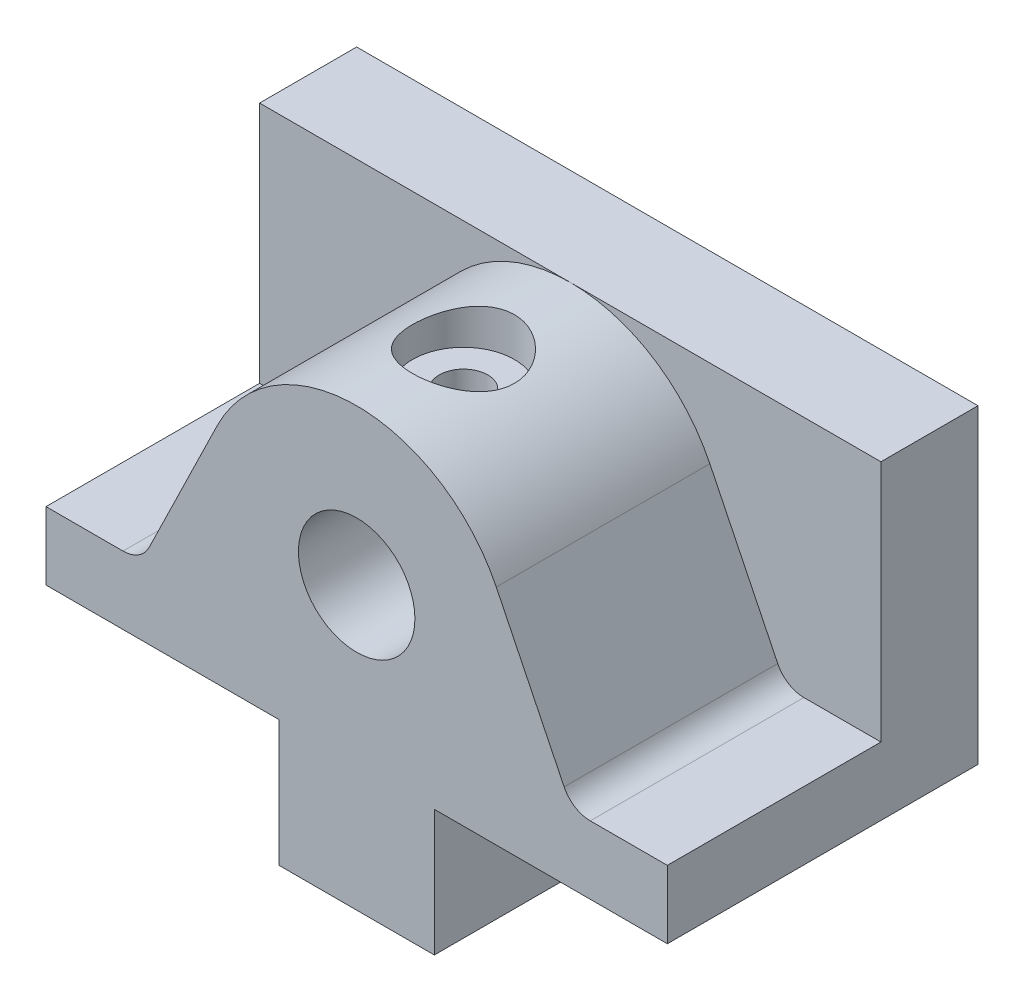
ISO-10303-21;
HEADER;
FILE_DESCRIPTION(('STEP AP214'),'2;1');
FILE_NAME('part.step','',(''),(''),'','','');
FILE_SCHEMA(('AUTOMOTIVE_DESIGN { 1 0 10303 214 1 1 1 1 }'));
ENDSEC;
DATA;
#1=APPLICATION_CONTEXT('core data for automotive mechanical design processes');
#2=APPLICATION_PROTOCOL_DEFINITION('international standard','automotive_design',2000,#1);
#3=PRODUCT_CONTEXT('',#1,'mechanical');
#4=PRODUCT('Part','Part','',(#3));
#5=PRODUCT_RELATED_PRODUCT_CATEGORY('part','',(#4));
#6=PRODUCT_DEFINITION_FORMATION('','',#4);
#7=PRODUCT_DEFINITION_CONTEXT('part definition',#1,'design');
#8=PRODUCT_DEFINITION('design','',#6,#7);
#9=PRODUCT_DEFINITION_SHAPE('','',#8);
#10=(LENGTH_UNIT() NAMED_UNIT(*) SI_UNIT(.MILLI.,.METRE.));
#11=(NAMED_UNIT(*) PLANE_ANGLE_UNIT() SI_UNIT($,.RADIAN.));
#12=(NAMED_UNIT(*) SI_UNIT($,.STERADIAN.) SOLID_ANGLE_UNIT());
#13=UNCERTAINTY_MEASURE_WITH_UNIT(LENGTH_MEASURE(1.E-05),#10,'distance_accuracy_value','');
#14=(GEOMETRIC_REPRESENTATION_CONTEXT(3) GLOBAL_UNCERTAINTY_ASSIGNED_CONTEXT((#13)) GLOBAL_UNIT_ASSIGNED_CONTEXT((#10,
#11,#12)) REPRESENTATION_CONTEXT('',''));
#15=CARTESIAN_POINT('',(0.,0.,0.));
#16=DIRECTION('',(0.,0.,1.));
#17=DIRECTION('',(1.,0.,0.));
#18=AXIS2_PLACEMENT_3D('',#15,#16,#17);
#19=CARTESIAN_POINT('',(0.,0.,32.));
#20=DIRECTION('',(0.,0.,-1.));
#21=DIRECTION('',(-1.,0.,0.));
#22=AXIS2_PLACEMENT_3D('',#19,#20,#21);
#23=PLANE('',#22);
#24=CARTESIAN_POINT('',(-5.13901892937107,9.13494809688582,32.));
#25=DIRECTION('',(0.,0.,1.));
#26=DIRECTION('',(1.,0.,0.));
#27=AXIS2_PLACEMENT_3D('',#24,#25,#26);
#28=CIRCLE('',#27,6.);
#29=CARTESIAN_POINT('',(0.86098107062893,9.13494809688582,32.));
#30=VERTEX_POINT('',#29);
#31=EDGE_CURVE('E332',#30,#30,#28,.T.);
#32=ORIENTED_EDGE('',*,*,#31,.F.);
#33=EDGE_LOOP('',(#32));
#34=FACE_BOUND('',#33,.T.);
#35=DIRECTION('',(0.438371146789079,-0.898794046299166,0.));
#36=VECTOR('',#35,1.);
#37=CARTESIAN_POINT('',(13.8284659552022,6.7445934962257,32.));
#38=LINE('',#37,#36);
#39=CARTESIAN_POINT('',(9.24168581141559,16.1488864455111,32.));
#40=VERTEX_POINT('',#39);
#41=CARTESIAN_POINT('',(16.2304313321552,1.81983465651859,32.));
#42=VERTEX_POINT('',#41);
#43=EDGE_CURVE('E420',#40,#42,#38,.T.);
#44=ORIENTED_EDGE('',*,*,#43,.F.);
#45=CARTESIAN_POINT('',(-5.13901892937107,9.13494809688582,32.));
#46=DIRECTION('',(0.,0.,1.));
#47=DIRECTION('',(1.,0.,0.));
#48=AXIS2_PLACEMENT_3D('',#45,#46,#47);
#49=CIRCLE('',#48,16.);
#50=CARTESIAN_POINT('',(-19.5197236701577,16.1488864455111,32.));
#51=VERTEX_POINT('',#50);
#52=EDGE_CURVE('E321',#40,#51,#49,.T.);
#53=ORIENTED_EDGE('',*,*,#52,.T.);
#54=DIRECTION('',(-0.438371146789079,-0.898794046299166,0.));
#55=VECTOR('',#54,1.);
#56=CARTESIAN_POINT('',(-22.1313808603564,10.7941956755586,32.));
#57=LINE('',#56,#55);
#58=CARTESIAN_POINT('',(-26.5084691908974,1.81983465651859,32.));
#59=VERTEX_POINT('',#58);
#60=EDGE_CURVE('E315',#51,#59,#57,.T.);
#61=ORIENTED_EDGE('',*,*,#60,.T.);
#62=CARTESIAN_POINT('',(-29.2048513297949,3.13494809688582,32.));
#63=DIRECTION('',(0.,0.,-1.));
#64=DIRECTION('',(-1.,0.,0.));
#65=AXIS2_PLACEMENT_3D('',#62,#63,#64);
#66=CIRCLE('',#65,3.);
#67=CARTESIAN_POINT('',(-29.2048513297949,0.134948096885821,32.));
#68=VERTEX_POINT('',#67);
#69=EDGE_CURVE('E309',#59,#68,#66,.T.);
#70=ORIENTED_EDGE('',*,*,#69,.T.);
#71=DIRECTION('',(-1.,0.,0.));
#72=VECTOR('',#71,1.);
#73=CARTESIAN_POINT('',(0.,0.134948096885832,32.));
#74=LINE('',#73,#72);
#75=CARTESIAN_POINT('',(-37.1390189293711,0.13494809688582,32.));
#76=VERTEX_POINT('',#75);
#77=EDGE_CURVE('E312',#68,#76,#74,.T.);
#78=ORIENTED_EDGE('',*,*,#77,.T.);
#79=DIRECTION('',(0.,-1.,0.));
#80=VECTOR('',#79,1.);
#81=CARTESIAN_POINT('',(-37.1390189293711,-6.86505190311419,32.));
#82=LINE('',#81,#80);
#83=CARTESIAN_POINT('',(-37.1390189293711,-6.86505190311419,32.));
#84=VERTEX_POINT('',#83);
#85=EDGE_CURVE('E367',#76,#84,#82,.T.);
#86=ORIENTED_EDGE('',*,*,#85,.T.);
#87=DIRECTION('',(1.,0.,0.));
#88=VECTOR('',#87,1.);
#89=CARTESIAN_POINT('',(26.8609810706289,-6.86505190311418,32.));
#90=LINE('',#89,#88);
#91=CARTESIAN_POINT('',(-13.1390189293711,-6.86505190311419,32.));
#92=VERTEX_POINT('',#91);
#93=EDGE_CURVE('E371',#84,#92,#90,.T.);
#94=ORIENTED_EDGE('',*,*,#93,.T.);
#95=DIRECTION('',(0.,-1.,0.));
#96=VECTOR('',#95,1.);
#97=CARTESIAN_POINT('',(-13.1390189293711,-6.86505190311419,32.));
#98=LINE('',#97,#96);
#99=CARTESIAN_POINT('',(-13.1390189293711,-19.8650519031142,32.));
#100=VERTEX_POINT('',#99);
#101=EDGE_CURVE('E338',#92,#100,#98,.T.);
#102=ORIENTED_EDGE('',*,*,#101,.T.);
#103=DIRECTION('',(1.,0.,0.));
#104=VECTOR('',#103,1.);
#105=CARTESIAN_POINT('',(-5.13901892937107,-19.8650519031142,32.));
#106=LINE('',#105,#104);
#107=CARTESIAN_POINT('',(2.86098107062893,-19.8650519031142,32.));
#108=VERTEX_POINT('',#107);
#109=EDGE_CURVE('E352',#100,#108,#106,.T.);
#110=ORIENTED_EDGE('',*,*,#109,.T.);
#111=DIRECTION('',(0.,1.,0.));
#112=VECTOR('',#111,1.);
#113=CARTESIAN_POINT('',(2.86098107062893,-19.8650519031142,32.));
#114=LINE('',#113,#112);
#115=CARTESIAN_POINT('',(2.86098107062893,-6.86505190311419,32.));
#116=VERTEX_POINT('',#115);
#117=EDGE_CURVE('E345',#108,#116,#114,.T.);
#118=ORIENTED_EDGE('',*,*,#117,.T.);
#119=CARTESIAN_POINT('',(26.8609810706289,-6.86505190311418,32.));
#120=VERTEX_POINT('',#119);
#121=EDGE_CURVE('E369',#116,#120,#90,.T.);
#122=ORIENTED_EDGE('',*,*,#121,.T.);
#123=DIRECTION('',(0.,1.,0.));
#124=VECTOR('',#123,1.);
#125=CARTESIAN_POINT('',(26.8609810706289,25.1349480968858,32.));
#126=LINE('',#125,#124);
#127=CARTESIAN_POINT('',(26.8609810706289,0.134948096885821,32.));
#128=VERTEX_POINT('',#127);
#129=EDGE_CURVE('E374',#120,#128,#126,.T.);
#130=ORIENTED_EDGE('',*,*,#129,.T.);
#131=DIRECTION('',(-1.,0.,0.));
#132=VECTOR('',#131,1.);
#133=CARTESIAN_POINT('',(0.,0.134948096885827,32.));
#134=LINE('',#133,#132);
#135=CARTESIAN_POINT('',(18.9268134710527,0.134948096885821,32.));
#136=VERTEX_POINT('',#135);
#137=EDGE_CURVE('E417',#128,#136,#134,.T.);
#138=ORIENTED_EDGE('',*,*,#137,.T.);
#139=CARTESIAN_POINT('',(18.9268134710527,3.13494809688582,32.));
#140=DIRECTION('',(0.,0.,-1.));
#141=DIRECTION('',(-1.,0.,0.));
#142=AXIS2_PLACEMENT_3D('',#139,#140,#141);
#143=CIRCLE('',#142,3.);
#144=EDGE_CURVE('E79',#136,#42,#143,.T.);
#145=ORIENTED_EDGE('',*,*,#144,.T.);
#146=EDGE_LOOP('',(#44,#53,#61,#70,#78,#86,#94,#102,#110,#118,#122,#130,#138,#145));
#147=FACE_BOUND('',#146,.T.);
#148=ADVANCED_FACE('F66',(#34,#147),#23,.F.);
#149=CARTESIAN_POINT('',(26.8609810706289,25.1349480968858,32.));
#150=DIRECTION('',(-1.,0.,0.));
#151=DIRECTION('',(0.,-1.,0.));
#152=AXIS2_PLACEMENT_3D('',#149,#150,#151);
#153=PLANE('',#152);
#154=DIRECTION('',(0.,0.,1.));
#155=VECTOR('',#154,1.);
#156=CARTESIAN_POINT('',(26.8609810706289,0.134948096885821,10.));
#157=LINE('',#156,#155);
#158=CARTESIAN_POINT('',(26.8609810706289,0.134948096885821,10.));
#159=VERTEX_POINT('',#158);
#160=EDGE_CURVE('E325',#159,#128,#157,.T.);
#161=ORIENTED_EDGE('',*,*,#160,.T.);
#162=ORIENTED_EDGE('',*,*,#129,.F.);
#163=DIRECTION('',(0.,0.,-1.));
#164=VECTOR('',#163,1.);
#165=CARTESIAN_POINT('',(26.8609810706289,-6.86505190311418,32.));
#166=LINE('',#165,#164);
#167=CARTESIAN_POINT('',(26.8609810706289,-6.86505190311418,0.));
#168=VERTEX_POINT('',#167);
#169=EDGE_CURVE('E392',#120,#168,#166,.T.);
#170=ORIENTED_EDGE('',*,*,#169,.T.);
#171=DIRECTION('',(0.,1.,0.));
#172=VECTOR('',#171,1.);
#173=CARTESIAN_POINT('',(26.8609810706289,25.1349480968858,0.));
#174=LINE('',#173,#172);
#175=CARTESIAN_POINT('',(26.8609810706289,25.1349480968858,0.));
#176=VERTEX_POINT('',#175);
#177=EDGE_CURVE('E384',#168,#176,#174,.T.);
#178=ORIENTED_EDGE('',*,*,#177,.T.);
#179=DIRECTION('',(0.,0.,-1.));
#180=VECTOR('',#179,1.);
#181=CARTESIAN_POINT('',(26.8609810706289,25.1349480968858,32.));
#182=LINE('',#181,#180);
#183=CARTESIAN_POINT('',(26.8609810706289,25.1349480968858,10.));
#184=VERTEX_POINT('',#183);
#185=EDGE_CURVE('E390',#184,#176,#182,.T.);
#186=ORIENTED_EDGE('',*,*,#185,.F.);
#187=DIRECTION('',(0.,1.,0.));
#188=VECTOR('',#187,1.);
#189=CARTESIAN_POINT('',(26.8609810706289,0.,10.));
#190=LINE('',#189,#188);
#191=EDGE_CURVE('E423',#159,#184,#190,.T.);
#192=ORIENTED_EDGE('',*,*,#191,.F.);
#193=EDGE_LOOP('',(#161,#162,#170,#178,#186,#192));
#194=FACE_BOUND('',#193,.T.);
#195=ADVANCED_FACE('F246',(#194),#153,.F.);
#196=CARTESIAN_POINT('',(-37.1390189293711,25.1349480968858,32.));
#197=DIRECTION('',(0.,-1.,0.));
#198=DIRECTION('',(0.,0.,-1.));
#199=AXIS2_PLACEMENT_3D('',#196,#197,#198);
#200=PLANE('',#199);
#201=DIRECTION('',(-1.,0.,0.));
#202=VECTOR('',#201,1.);
#203=CARTESIAN_POINT('',(0.,25.1349480968858,10.));
#204=LINE('',#203,#202);
#205=CARTESIAN_POINT('',(-5.13901892937107,25.1349480968858,10.));
#206=VERTEX_POINT('',#205);
#207=EDGE_CURVE('E414',#184,#206,#204,.T.);
#208=ORIENTED_EDGE('',*,*,#207,.F.);
#209=ORIENTED_EDGE('',*,*,#185,.T.);
#210=DIRECTION('',(-1.,0.,0.));
#211=VECTOR('',#210,1.);
#212=CARTESIAN_POINT('',(-37.1390189293711,25.1349480968858,0.));
#213=LINE('',#212,#211);
#214=CARTESIAN_POINT('',(-37.1390189293711,25.1349480968858,0.));
#215=VERTEX_POINT('',#214);
#216=EDGE_CURVE('E370',#176,#215,#213,.T.);
#217=ORIENTED_EDGE('',*,*,#216,.T.);
#218=DIRECTION('',(0.,0.,-1.));
#219=VECTOR('',#218,1.);
#220=CARTESIAN_POINT('',(-37.1390189293711,25.1349480968858,32.));
#221=LINE('',#220,#219);
#222=CARTESIAN_POINT('',(-37.1390189293711,25.1349480968858,10.));
#223=VERTEX_POINT('',#222);
#224=EDGE_CURVE('E377',#223,#215,#221,.T.);
#225=ORIENTED_EDGE('',*,*,#224,.F.);
#226=DIRECTION('',(-1.,0.,0.));
#227=VECTOR('',#226,1.);
#228=CARTESIAN_POINT('',(0.,25.1349480968858,10.));
#229=LINE('',#228,#227);
#230=EDGE_CURVE('E408',#206,#223,#229,.T.);
#231=ORIENTED_EDGE('',*,*,#230,.F.);
#232=EDGE_LOOP('',(#208,#209,#217,#225,#231));
#233=FACE_BOUND('',#232,.T.);
#234=ADVANCED_FACE('F252',(#233),#200,.F.);
#235=CARTESIAN_POINT('',(-37.1390189293711,-6.86505190311419,32.));
#236=DIRECTION('',(1.,0.,0.));
#237=DIRECTION('',(0.,1.,0.));
#238=AXIS2_PLACEMENT_3D('',#235,#236,#237);
#239=PLANE('',#238);
#240=DIRECTION('',(0.,0.,1.));
#241=VECTOR('',#240,1.);
#242=CARTESIAN_POINT('',(-37.1390189293711,0.13494809688582,10.));
#243=LINE('',#242,#241);
#244=CARTESIAN_POINT('',(-37.1390189293711,0.13494809688582,10.));
#245=VERTEX_POINT('',#244);
#246=EDGE_CURVE('E319',#245,#76,#243,.T.);
#247=ORIENTED_EDGE('',*,*,#246,.F.);
#248=DIRECTION('',(0.,-1.,0.));
#249=VECTOR('',#248,1.);
#250=CARTESIAN_POINT('',(-37.1390189293711,0.,10.));
#251=LINE('',#250,#249);
#252=EDGE_CURVE('E403',#223,#245,#251,.T.);
#253=ORIENTED_EDGE('',*,*,#252,.F.);
#254=ORIENTED_EDGE('',*,*,#224,.T.);
#255=DIRECTION('',(0.,-1.,0.));
#256=VECTOR('',#255,1.);
#257=CARTESIAN_POINT('',(-37.1390189293711,-6.86505190311419,0.));
#258=LINE('',#257,#256);
#259=CARTESIAN_POINT('',(-37.1390189293711,-6.86505190311419,0.));
#260=VERTEX_POINT('',#259);
#261=EDGE_CURVE('E359',#215,#260,#258,.T.);
#262=ORIENTED_EDGE('',*,*,#261,.T.);
#263=DIRECTION('',(0.,0.,-1.));
#264=VECTOR('',#263,1.);
#265=CARTESIAN_POINT('',(-37.1390189293711,-6.86505190311419,32.));
#266=LINE('',#265,#264);
#267=EDGE_CURVE('E395',#84,#260,#266,.T.);
#268=ORIENTED_EDGE('',*,*,#267,.F.);
#269=ORIENTED_EDGE('',*,*,#85,.F.);
#270=EDGE_LOOP('',(#247,#253,#254,#262,#268,#269));
#271=FACE_BOUND('',#270,.T.);
#272=ADVANCED_FACE('F267',(#271),#239,.F.);
#273=CARTESIAN_POINT('',(26.8609810706289,-6.86505190311418,32.));
#274=DIRECTION('',(0.,1.,0.));
#275=DIRECTION('',(-1.,0.,0.));
#276=AXIS2_PLACEMENT_3D('',#273,#274,#275);
#277=PLANE('',#276);
#278=DIRECTION('',(0.,0.,1.));
#279=VECTOR('',#278,1.);
#280=CARTESIAN_POINT('',(2.86098107062893,-6.86505190311419,0.));
#281=LINE('',#280,#279);
#282=CARTESIAN_POINT('',(2.86098107062893,-6.86505190311419,0.));
#283=VERTEX_POINT('',#282);
#284=EDGE_CURVE('E357',#283,#116,#281,.T.);
#285=ORIENTED_EDGE('',*,*,#284,.F.);
#286=DIRECTION('',(1.,0.,0.));
#287=VECTOR('',#286,1.);
#288=CARTESIAN_POINT('',(26.8609810706289,-6.86505190311418,0.));
#289=LINE('',#288,#287);
#290=EDGE_CURVE('E380',#283,#168,#289,.T.);
#291=ORIENTED_EDGE('',*,*,#290,.T.);
#292=ORIENTED_EDGE('',*,*,#169,.F.);
#293=ORIENTED_EDGE('',*,*,#121,.F.);
#294=EDGE_LOOP('',(#285,#291,#292,#293));
#295=FACE_BOUND('',#294,.T.);
#296=ADVANCED_FACE('F272',(#295),#277,.F.);
#297=CARTESIAN_POINT('',(-13.1390189293711,-6.86505190311419,0.));
#298=VERTEX_POINT('',#297);
#299=EDGE_CURVE('E381',#260,#298,#289,.T.);
#300=ORIENTED_EDGE('',*,*,#299,.T.);
#301=DIRECTION('',(0.,0.,1.));
#302=VECTOR('',#301,1.);
#303=CARTESIAN_POINT('',(-13.1390189293711,-6.86505190311419,0.));
#304=LINE('',#303,#302);
#305=EDGE_CURVE('E349',#298,#92,#304,.T.);
#306=ORIENTED_EDGE('',*,*,#305,.T.);
#307=ORIENTED_EDGE('',*,*,#93,.F.);
#308=ORIENTED_EDGE('',*,*,#267,.T.);
#309=EDGE_LOOP('',(#300,#306,#307,#308));
#310=FACE_BOUND('',#309,.T.);
#311=ADVANCED_FACE('F264',(#310),#277,.F.);
#312=CARTESIAN_POINT('',(0.,0.,0.));
#313=DIRECTION('',(0.,0.,-1.));
#314=DIRECTION('',(-1.,0.,0.));
#315=AXIS2_PLACEMENT_3D('',#312,#313,#314);
#316=PLANE('',#315);
#317=ORIENTED_EDGE('',*,*,#261,.F.);
#318=ORIENTED_EDGE('',*,*,#216,.F.);
#319=ORIENTED_EDGE('',*,*,#177,.F.);
#320=ORIENTED_EDGE('',*,*,#290,.F.);
#321=DIRECTION('',(0.,1.,0.));
#322=VECTOR('',#321,1.);
#323=CARTESIAN_POINT('',(2.86098107062893,-19.8650519031142,0.));
#324=LINE('',#323,#322);
#325=CARTESIAN_POINT('',(2.86098107062893,-19.8650519031142,0.));
#326=VERTEX_POINT('',#325);
#327=EDGE_CURVE('E347',#326,#283,#324,.T.);
#328=ORIENTED_EDGE('',*,*,#327,.F.);
#329=DIRECTION('',(1.,0.,0.));
#330=VECTOR('',#329,1.);
#331=CARTESIAN_POINT('',(-13.1390189293711,-19.8650519031142,0.));
#332=LINE('',#331,#330);
#333=CARTESIAN_POINT('',(-13.1390189293711,-19.8650519031142,0.));
#334=VERTEX_POINT('',#333);
#335=EDGE_CURVE('E344',#334,#326,#332,.T.);
#336=ORIENTED_EDGE('',*,*,#335,.F.);
#337=DIRECTION('',(0.,-1.,0.));
#338=VECTOR('',#337,1.);
#339=CARTESIAN_POINT('',(-13.1390189293711,-6.86505190311419,0.));
#340=LINE('',#339,#338);
#341=EDGE_CURVE('E341',#298,#334,#340,.T.);
#342=ORIENTED_EDGE('',*,*,#341,.F.);
#343=ORIENTED_EDGE('',*,*,#299,.F.);
#344=EDGE_LOOP('',(#317,#318,#319,#320,#328,#336,#342,#343));
#345=FACE_BOUND('',#344,.T.);
#346=ADVANCED_FACE('F260',(#345),#316,.T.);
#347=CARTESIAN_POINT('',(2.86098107062893,-19.8650519031142,0.));
#348=DIRECTION('',(1.,0.,0.));
#349=DIRECTION('',(0.,0.,-1.));
#350=AXIS2_PLACEMENT_3D('',#347,#348,#349);
#351=PLANE('',#350);
#352=ORIENTED_EDGE('',*,*,#117,.F.);
#353=DIRECTION('',(0.,0.,1.));
#354=VECTOR('',#353,1.);
#355=CARTESIAN_POINT('',(2.86098107062893,-19.8650519031142,0.));
#356=LINE('',#355,#354);
#357=EDGE_CURVE('E360',#326,#108,#356,.T.);
#358=ORIENTED_EDGE('',*,*,#357,.F.);
#359=ORIENTED_EDGE('',*,*,#327,.T.);
#360=ORIENTED_EDGE('',*,*,#284,.T.);
#361=EDGE_LOOP('',(#352,#358,#359,#360));
#362=FACE_BOUND('',#361,.T.);
#363=ADVANCED_FACE('F263',(#362),#351,.T.);
#364=CARTESIAN_POINT('',(-5.13901892937107,-19.8650519031142,0.));
#365=DIRECTION('',(0.,-1.,0.));
#366=DIRECTION('',(0.,0.,-1.));
#367=AXIS2_PLACEMENT_3D('',#364,#365,#366);
#368=PLANE('',#367);
#369=CARTESIAN_POINT('',(-5.13901892937107,-19.8650519031142,24.));
#370=DIRECTION('',(0.,-1.,0.));
#371=DIRECTION('',(0.,0.,-1.));
#372=AXIS2_PLACEMENT_3D('',#369,#370,#371);
#373=CIRCLE('',#372,2.49999999999999);
#374=CARTESIAN_POINT('',(-5.13901892937107,-19.8650519031142,21.5));
#375=VERTEX_POINT('',#374);
#376=EDGE_CURVE('E203',#375,#375,#373,.T.);
#377=ORIENTED_EDGE('',*,*,#376,.F.);
#378=EDGE_LOOP('',(#377));
#379=FACE_BOUND('',#378,.T.);
#380=CARTESIAN_POINT('',(-5.13901892937107,-19.8650519031142,8.));
#381=DIRECTION('',(0.,-1.,0.));
#382=DIRECTION('',(0.,0.,-1.));
#383=AXIS2_PLACEMENT_3D('',#380,#381,#382);
#384=CIRCLE('',#383,2.49999999999999);
#385=CARTESIAN_POINT('',(-5.13901892937107,-19.8650519031142,5.50000000000001));
#386=VERTEX_POINT('',#385);
#387=EDGE_CURVE('E202',#386,#386,#384,.T.);
#388=ORIENTED_EDGE('',*,*,#387,.F.);
#389=EDGE_LOOP('',(#388));
#390=FACE_BOUND('',#389,.T.);
#391=ORIENTED_EDGE('',*,*,#109,.F.);
#392=DIRECTION('',(0.,0.,1.));
#393=VECTOR('',#392,1.);
#394=CARTESIAN_POINT('',(-13.1390189293711,-19.8650519031142,0.));
#395=LINE('',#394,#393);
#396=EDGE_CURVE('E362',#334,#100,#395,.T.);
#397=ORIENTED_EDGE('',*,*,#396,.F.);
#398=ORIENTED_EDGE('',*,*,#335,.T.);
#399=ORIENTED_EDGE('',*,*,#357,.T.);
#400=EDGE_LOOP('',(#391,#397,#398,#399));
#401=FACE_BOUND('',#400,.T.);
#402=ADVANCED_FACE('F450',(#379,#390,#401),#368,.T.);
#403=CARTESIAN_POINT('',(-13.1390189293711,-6.86505190311419,0.));
#404=DIRECTION('',(-1.,0.,0.));
#405=DIRECTION('',(0.,-1.,0.));
#406=AXIS2_PLACEMENT_3D('',#403,#404,#405);
#407=PLANE('',#406);
#408=ORIENTED_EDGE('',*,*,#101,.F.);
#409=ORIENTED_EDGE('',*,*,#305,.F.);
#410=ORIENTED_EDGE('',*,*,#341,.T.);
#411=ORIENTED_EDGE('',*,*,#396,.T.);
#412=EDGE_LOOP('',(#408,#409,#410,#411));
#413=FACE_BOUND('',#412,.T.);
#414=ADVANCED_FACE('F258',(#413),#407,.T.);
#415=CARTESIAN_POINT('',(-5.13901892937107,9.13494809688582,10.));
#416=DIRECTION('',(0.,0.,1.));
#417=DIRECTION('',(1.,0.,0.));
#418=AXIS2_PLACEMENT_3D('',#415,#416,#417);
#419=CYLINDRICAL_SURFACE('',#418,6.);
#420=CARTESIAN_POINT('',(-5.13901892937107,15.1349480968858,23.5));
#421=CARTESIAN_POINT('',(-5.00511501120728,15.1349443797949,23.4999952878604));
#422=CARTESIAN_POINT('',(-4.87097940437964,15.1304146650975,23.4891786843995));
#423=CARTESIAN_POINT('',(-4.60652090937996,15.112749254772,23.4463192619064));
#424=CARTESIAN_POINT('',(-4.4762088995624,15.0995911028837,23.4142210532185));
#425=CARTESIAN_POINT('',(-4.22364233607185,15.0660743879459,23.3301785119407));
#426=CARTESIAN_POINT('',(-4.10136211502723,15.0457402333061,23.2783014076769));
#427=CARTESIAN_POINT('',(-3.86735918157374,14.9998536894203,23.1564541669781));
#428=CARTESIAN_POINT('',(-3.7556332852082,14.9743028812993,23.0864895110252));
#429=CARTESIAN_POINT('',(-3.5401221893251,14.9191047030845,22.9267420881925));
#430=CARTESIAN_POINT('',(-3.43693641234066,14.8893231739201,22.8361973967483));
#431=CARTESIAN_POINT('',(-3.24669926917398,14.8296023677381,22.6394713160995));
#432=CARTESIAN_POINT('',(-3.15965639813118,14.7996630161414,22.5332817462849));
#433=CARTESIAN_POINT('',(-2.99994418060624,14.7413685361681,22.3019464489895));
#434=CARTESIAN_POINT('',(-2.92819276767697,14.7131638351618,22.1761251042486));
#435=CARTESIAN_POINT('',(-2.80714011621008,14.663659543218,21.9128534830571));
#436=CARTESIAN_POINT('',(-2.75782731228309,14.6423563966908,21.7754092407429));
#437=CARTESIAN_POINT('',(-2.68552696347262,14.6105192048412,21.4996926167385));
#438=CARTESIAN_POINT('',(-2.66138577191106,14.5995158499753,21.361779033289));
#439=CARTESIAN_POINT('',(-2.6365147299231,14.5881746212221,21.0834534145536));
#440=CARTESIAN_POINT('',(-2.63577196825938,14.5878308653771,20.9430427999296));
#441=CARTESIAN_POINT('',(-2.65684992211953,14.5974504881157,20.6751998791476));
#442=CARTESIAN_POINT('',(-2.67694530713094,14.6066257513617,20.5475978068758));
#443=CARTESIAN_POINT('',(-2.73623510904966,14.6329177523583,20.2977758179945));
#444=CARTESIAN_POINT('',(-2.77543318362595,14.6500360109562,20.1755569370152));
#445=CARTESIAN_POINT('',(-2.87257975482128,14.6906717923419,19.9368845940184));
#446=CARTESIAN_POINT('',(-2.93090949858679,14.7143177358688,19.8206091581736));
#447=CARTESIAN_POINT('',(-3.06439407775939,14.7653147197073,19.5990445322394));
#448=CARTESIAN_POINT('',(-3.13955554833186,14.7926672194813,19.4937596987729));
#449=CARTESIAN_POINT('',(-3.31202699828353,14.8508076344455,19.2878000825344));
#450=CARTESIAN_POINT('',(-3.41067196295605,14.8816905249753,19.1882668652292));
#451=CARTESIAN_POINT('',(-3.62355974726801,14.9414615591364,19.0067729940816));
#452=CARTESIAN_POINT('',(-3.73780621047415,14.970349234426,18.9248164566156));
#453=CARTESIAN_POINT('',(-3.98212303198433,15.0237137680153,18.7791283527675));
#454=CARTESIAN_POINT('',(-4.11249776447571,15.0480734277525,18.7158611096987));
#455=CARTESIAN_POINT('',(-4.3833141243174,15.0887377251819,18.6125577207935));
#456=CARTESIAN_POINT('',(-4.523750139781,15.1050468138018,18.5725087361124));
#457=CARTESIAN_POINT('',(-4.80116270267861,15.1269409206135,18.5191680157467));
#458=CARTESIAN_POINT('',(-4.93779635881379,15.1331389178283,18.5043442851125));
#459=CARTESIAN_POINT('',(-5.21172824036325,15.1360691042607,18.4973075527718));
#460=CARTESIAN_POINT('',(-5.34902626367634,15.1328040111246,18.505088059496));
#461=CARTESIAN_POINT('',(-5.61321541405394,15.1175724500246,18.5419421696121));
#462=CARTESIAN_POINT('',(-5.74028486264984,15.1060458425656,18.5699399081944));
#463=CARTESIAN_POINT('',(-5.98778442731324,15.0759202323341,18.6449363890816));
#464=CARTESIAN_POINT('',(-6.10821370240778,15.0573203360799,18.6919375319006));
#465=CARTESIAN_POINT('',(-6.34323692910935,15.0141135097891,18.8051419514242));
#466=CARTESIAN_POINT('',(-6.45753340308175,14.9893379262714,18.8718963662921));
#467=CARTESIAN_POINT('',(-6.67371136183389,14.9364241884676,19.0221067555834));
#468=CARTESIAN_POINT('',(-6.77558763457481,14.9082846322605,19.1055697030587));
#469=CARTESIAN_POINT('',(-6.97168578991974,14.8491898547945,19.2938064665447));
#470=CARTESIAN_POINT('',(-7.06484032533129,14.8181771287061,19.3996770059721));
#471=CARTESIAN_POINT('',(-7.23235862158152,14.7586348322462,19.6260425518712));
#472=CARTESIAN_POINT('',(-7.30671811508133,14.7301058267557,19.746540870345));
#473=CARTESIAN_POINT('',(-7.43533813354716,14.6785758217645,20.0012283506036));
#474=CARTESIAN_POINT('',(-7.48929729412557,14.6556593479838,20.1355880710238));
#475=CARTESIAN_POINT('',(-7.5733672083946,14.6191152100692,20.4127411876261));
#476=CARTESIAN_POINT('',(-7.60349762661523,14.6054798880165,20.5555275249888));
#477=CARTESIAN_POINT('',(-7.63710053637638,14.5902113876166,20.8336373983781));
#478=CARTESIAN_POINT('',(-7.6424465377319,14.587735116177,20.968689324512));
#479=CARTESIAN_POINT('',(-7.63133043975107,14.5928251571584,21.2376857223555));
#480=CARTESIAN_POINT('',(-7.61487168829985,14.6003899278859,21.3716303609001));
#481=CARTESIAN_POINT('',(-7.56218702532951,14.6239391227463,21.6281854946778));
#482=CARTESIAN_POINT('',(-7.52691700207309,14.6395151931404,21.7510333459775));
#483=CARTESIAN_POINT('',(-7.43854549214069,14.6770117215449,21.989096043664));
#484=CARTESIAN_POINT('',(-7.38543899497195,14.6989339620361,22.104308734336));
#485=CARTESIAN_POINT('',(-7.25922465311026,14.7482871854184,22.3313917881471));
#486=CARTESIAN_POINT('',(-7.18510616687242,14.7759701409266,22.4426446459478));
#487=CARTESIAN_POINT('',(-7.02038705533345,14.833021888199,22.6517202931151));
#488=CARTESIAN_POINT('',(-6.92978071500822,14.8623912620863,22.7495384050324));
#489=CARTESIAN_POINT('',(-6.72682309835944,14.9220759128167,22.9362973056175));
#490=CARTESIAN_POINT('',(-6.6133687080592,14.9523042886359,23.0240726428278));
#491=CARTESIAN_POINT('',(-6.37221878895149,15.008151127884,23.1793991300421));
#492=CARTESIAN_POINT('',(-6.24451680678796,15.0337674884875,23.2469410639968));
#493=CARTESIAN_POINT('',(-5.98048414279326,15.0771311806748,23.3584188704516));
#494=CARTESIAN_POINT('',(-5.84433098578693,15.0950015873324,23.4027264942901));
#495=CARTESIAN_POINT('',(-5.56583571144133,15.1213704466447,23.4674156875296));
#496=CARTESIAN_POINT('',(-5.42351443549306,15.12989823731,23.4878721682058));
#497=CARTESIAN_POINT('',(-5.2570714417205,15.1338337630287,23.4973238417862));
#498=CARTESIAN_POINT('',(-5.23347586425047,15.1342510230358,23.498326602503));
#499=CARTESIAN_POINT('',(-5.1862622384404,15.1348085182724,23.4996650982568));
#500=CARTESIAN_POINT('',(-5.16264419003622,15.1349487527086,23.5000008313836));
#501=CARTESIAN_POINT('',(-5.13901892937107,15.1349480968858,23.5));
#502=B_SPLINE_CURVE_WITH_KNOTS('',3,(#420,#421,#422,#423,#424,#425,#426,#427,#428,#429,#430,
#431,#432,#433,#434,#435,#436,#437,#438,#439,#440,#441,#442,#443,#444,#445,#446,#447,#448,#449,
#450,#451,#452,#453,#454,#455,#456,#457,#458,#459,#460,#461,#462,#463,#464,#465,#466,#467,#468,
#469,#470,#471,#472,#473,#474,#475,#476,#477,#478,#479,#480,#481,#482,#483,#484,#485,#486,#487,
#488,#489,#490,#491,#492,#493,#494,#495,#496,#497,#498,#499,#500,#501),.UNSPECIFIED.,.T.,.F.,(4,
2,2,2,2,2,2,2,2,2,2,2,2,2,2,2,2,2,2,2,2,2,2,2,2,2,2,2,2,2,2,2,2,2,2,2,2,2,2,2,4),(0.,
0.401613837767877,0.804277081257391,1.2055837038126,1.60676887370594,2.02635872577613,
2.4461687626293,2.88663449078249,3.32687293461175,3.74590546275114,4.16470676498091,
4.55140314405112,4.93817359454424,5.33317426117427,5.72833091434411,6.15688282255792,
6.58553498629175,7.02408110121625,7.46238448436592,7.872968867865,8.28343534986342,
8.67353179471441,9.06367753203568,9.4659427054432,9.86837610938989,10.2995697605859,
10.7308612248068,11.1682957671904,11.6053689414916,12.0087975511928,12.4121642259507,
12.7967529992952,13.1814498990122,13.5892778679488,13.9972474685189,14.4349307000978,
14.8728129885716,15.3034571163877,15.7327450093864,15.8036033125921,15.8744618187069),.UNSPECIFIED.);
#503=CARTESIAN_POINT('',(-5.13901892937107,15.1349480968858,23.5));
#504=VERTEX_POINT('',#503);
#505=EDGE_CURVE('E216',#504,#504,#502,.T.);
#506=ORIENTED_EDGE('',*,*,#505,.T.);
#507=EDGE_LOOP('',(#506));
#508=FACE_BOUND('',#507,.T.);
#509=CARTESIAN_POINT('',(-5.13901892937107,9.13494809688582,10.));
#510=DIRECTION('',(0.,0.,1.));
#511=DIRECTION('',(1.,0.,0.));
#512=AXIS2_PLACEMENT_3D('',#509,#510,#511);
#513=CIRCLE('',#512,6.);
#514=CARTESIAN_POINT('',(0.86098107062893,9.13494809688582,10.));
#515=VERTEX_POINT('',#514);
#516=EDGE_CURVE('E335',#515,#515,#513,.T.);
#517=ORIENTED_EDGE('',*,*,#516,.F.);
#518=EDGE_LOOP('',(#517));
#519=FACE_BOUND('',#518,.T.);
#520=ORIENTED_EDGE('',*,*,#31,.T.);
#521=EDGE_LOOP('',(#520));
#522=FACE_BOUND('',#521,.T.);
#523=ADVANCED_FACE('F484',(#508,#519,#522),#419,.F.);
#524=CARTESIAN_POINT('',(0.,0.,10.));
#525=DIRECTION('',(0.,0.,1.));
#526=DIRECTION('',(1.,0.,0.));
#527=AXIS2_PLACEMENT_3D('',#524,#525,#526);
#528=PLANE('',#527);
#529=ORIENTED_EDGE('',*,*,#516,.T.);
#530=EDGE_LOOP('',(#529));
#531=FACE_BOUND('',#530,.T.);
#532=ADVANCED_FACE('F480',(#531),#528,.T.);
#533=CARTESIAN_POINT('',(-5.13901892937107,9.13494809688582,10.));
#534=DIRECTION('',(0.,0.,1.));
#535=DIRECTION('',(1.,0.,0.));
#536=AXIS2_PLACEMENT_3D('',#533,#534,#535);
#537=CYLINDRICAL_SURFACE('',#536,16.);
#538=CARTESIAN_POINT('',(-5.13901892937107,25.1349480968858,26.25));
#539=CARTESIAN_POINT('',(-4.85230943531208,25.1349482866263,26.250000534731));
#540=CARTESIAN_POINT('',(-4.56560092541967,25.127170162744,26.2264371563873));
#541=CARTESIAN_POINT('',(-4.00061316804785,25.0969066560921,26.1330830739779));
#542=CARTESIAN_POINT('',(-3.72233506116482,25.0744192924431,26.0632861436672));
#543=CARTESIAN_POINT('',(-3.1824372218777,25.0171845755204,25.8801076160714));
#544=CARTESIAN_POINT('',(-2.92079097987012,24.9824573408055,25.7667975137658));
#545=CARTESIAN_POINT('',(-2.42020997336871,24.9042961704123,25.5001149495774));
#546=CARTESIAN_POINT('',(-2.18127947933418,24.8608606023589,25.34673497497));
#547=CARTESIAN_POINT('',(-1.72488967798889,24.7682342656532,24.9988845958574));
#548=CARTESIAN_POINT('',(-1.50830248882678,24.7189088029136,24.8033080399097));
#549=CARTESIAN_POINT('',(-1.11026660899684,24.6207884577027,24.3787904179321));
#550=CARTESIAN_POINT('',(-0.92882533911377,24.5719936893317,24.1498423236084));
#551=CARTESIAN_POINT('',(-0.684500625806393,24.5025998660049,23.7824972479474));
#552=CARTESIAN_POINT('',(-0.606828817866472,24.4798145153317,23.6541120150121));
#553=CARTESIAN_POINT('',(-0.462627553879115,24.4364848442748,23.3908881855436));
#554=CARTESIAN_POINT('',(-0.39609369719267,24.4159396399264,23.2560521649401));
#555=CARTESIAN_POINT('',(-0.274704496169783,24.3777332863239,22.9808035106813));
#556=CARTESIAN_POINT('',(-0.219851311364011,24.3600726705147,22.8403898515122));
#557=CARTESIAN_POINT('',(-0.122348738251823,24.3282246487886,22.5550669720235));
#558=CARTESIAN_POINT('',(-0.079693825848601,24.314035671131,22.4101598196824));
#559=CARTESIAN_POINT('',(-0.00815365640696259,24.2900000614991,22.12164663784));
#560=CARTESIAN_POINT('',(0.021132954994148,24.2800276341164,21.978150565979));
#561=CARTESIAN_POINT('',(0.067624286508165,24.2641077631977,21.6890504881627));
#562=CARTESIAN_POINT('',(0.0848340165224944,24.2581586506908,21.5434473818911));
#563=CARTESIAN_POINT('',(0.107014496617428,24.2504789084187,21.251209374142));
#564=CARTESIAN_POINT('',(0.1119859831309,24.2487480248226,21.1045745352814));
#565=CARTESIAN_POINT('',(0.109640086968606,24.2495629038316,20.8114172421408));
#566=CARTESIAN_POINT('',(0.102323037112784,24.252108550612,20.6648947849247));
#567=CARTESIAN_POINT('',(0.0760737093384119,24.2611832214999,20.3795858193609));
#568=CARTESIAN_POINT('',(0.0576709373954406,24.2675305830979,20.2407444107946));
#569=CARTESIAN_POINT('',(0.00987646839583303,24.2838593905019,19.965135878479));
#570=CARTESIAN_POINT('',(-0.0195189328886843,24.293842061282,19.828369470134));
#571=CARTESIAN_POINT('',(-0.0890284779938072,24.3171395453815,19.5579235776126));
#572=CARTESIAN_POINT('',(-0.129139586792326,24.3304534151339,19.4242432309965));
#573=CARTESIAN_POINT('',(-0.21976549932751,24.3600332131651,19.1607425099973));
#574=CARTESIAN_POINT('',(-0.270284262670969,24.3763002647055,19.030923626288));
#575=CARTESIAN_POINT('',(-0.382184825638676,24.4115976090193,18.7740280823927));
#576=CARTESIAN_POINT('',(-0.443721340322375,24.4306664532545,18.6470240102845));
#577=CARTESIAN_POINT('',(-0.576658654522109,24.4708436529051,18.3986071202728));
#578=CARTESIAN_POINT('',(-0.648063037621822,24.4919527484106,18.2771963550716));
#579=CARTESIAN_POINT('',(-0.8763611607427,24.5574902191698,17.9224695079162));
#580=CARTESIAN_POINT('',(-1.04742230916805,24.6041559634095,17.6984705092107));
#581=CARTESIAN_POINT('',(-1.43239115931709,24.7010070125995,17.2703200516024));
#582=CARTESIAN_POINT('',(-1.64802601820736,24.7512510621512,17.0677415738092));
#583=CARTESIAN_POINT('',(-2.11085176915385,24.8475543362391,16.701186080797));
#584=CARTESIAN_POINT('',(-2.3580454996812,24.8936131837107,16.5372125415648));
#585=CARTESIAN_POINT('',(-2.88019228802511,24.9769225535402,16.2513585497954));
#586=CARTESIAN_POINT('',(-3.15538333485292,25.0140866707505,16.1298860994002));
#587=CARTESIAN_POINT('',(-3.7238046214958,25.0747947278252,15.9354362815639));
#588=CARTESIAN_POINT('',(-4.01702876126307,25.0983432457004,15.8624426127383));
#589=CARTESIAN_POINT('',(-4.59991990025136,25.1284135313587,15.7697735124911));
#590=CARTESIAN_POINT('',(-4.88921583178519,25.1356111771873,15.7479802824234));
#591=CARTESIAN_POINT('',(-5.46738177442768,25.134188584885,15.752313608519));
#592=CARTESIAN_POINT('',(-5.7562518472471,25.1255709235447,15.7784323583752));
#593=CARTESIAN_POINT('',(-6.31696626314543,25.0939322361578,15.8761633538778));
#594=CARTESIAN_POINT('',(-6.58906076603482,25.0713197934761,15.9464859323409));
#595=CARTESIAN_POINT('',(-7.11749495472013,25.0143785321431,16.1290359819631));
#596=CARTESIAN_POINT('',(-7.37383263970887,24.980048229165,16.2412687621479));
#597=CARTESIAN_POINT('',(-7.87082620780906,24.9020721995352,16.5076377504953));
#598=CARTESIAN_POINT('',(-8.11090563529219,24.8582086640805,16.6627819043168));
#599=CARTESIAN_POINT('',(-8.56240553952904,24.7661206969596,17.0095245869331));
#600=CARTESIAN_POINT('',(-8.77381747505966,24.7178949727215,17.2011339395183));
#601=CARTESIAN_POINT('',(-9.06982579124615,24.6449370594182,17.5167017467794));
#602=CARTESIAN_POINT('',(-9.16677544975272,24.6199818448896,17.6292785904917));
#603=CARTESIAN_POINT('',(-9.35086292110588,24.5709263538977,17.8623434685973));
#604=CARTESIAN_POINT('',(-9.43800419817659,24.5468257776575,17.9828286858773));
#605=CARTESIAN_POINT('',(-9.60190515059489,24.5001659257098,18.2310147310891));
#606=CARTESIAN_POINT('',(-9.67866042247877,24.477607305755,18.3587185872533));
#607=CARTESIAN_POINT('',(-9.82114800531938,24.4347259251372,18.6204301324265));
#608=CARTESIAN_POINT('',(-9.88688491148878,24.4144022336189,18.7544351635204));
#609=CARTESIAN_POINT('',(-10.0067066115146,24.3766526493513,19.0276117986305));
#610=CARTESIAN_POINT('',(-10.0608157193759,24.3592207276085,19.1667718941345));
#611=CARTESIAN_POINT('',(-10.1570569769241,24.3277707154531,19.4494900239032));
#612=CARTESIAN_POINT('',(-10.1991940242689,24.3137512293823,19.5930462330569));
#613=CARTESIAN_POINT('',(-10.2711098682579,24.2895871214504,19.8835209667143));
#614=CARTESIAN_POINT('',(-10.300890591777,24.2794418954475,20.0304389631996));
#615=CARTESIAN_POINT('',(-10.3477970195738,24.2633732806602,20.3265078699794));
#616=CARTESIAN_POINT('',(-10.3649233350867,24.2574496879623,20.4756586720694));
#617=CARTESIAN_POINT('',(-10.3858046077579,24.2502169759344,20.7674935852762));
#618=CARTESIAN_POINT('',(-10.3901856783825,24.2486918172609,20.9101278919414));
#619=CARTESIAN_POINT('',(-10.3873227181409,24.2496862840071,21.1953160643779));
#620=CARTESIAN_POINT('',(-10.3800747320371,24.2522072855939,21.3378698862774));
#621=CARTESIAN_POINT('',(-10.354022328124,24.2612142644841,21.6217268936588));
#622=CARTESIAN_POINT('',(-10.3352229140065,24.26769852503,21.7630305937829));
#623=CARTESIAN_POINT('',(-10.2862444345559,24.2844278771164,22.0434760888048));
#624=CARTESIAN_POINT('',(-10.2560610959695,24.2946743808748,22.1826170514157));
#625=CARTESIAN_POINT('',(-10.1852393927706,24.318393915182,22.455203960657));
#626=CARTESIAN_POINT('',(-10.1448019495486,24.3318046288804,22.5887075021135));
#627=CARTESIAN_POINT('',(-10.053562243324,24.3615549676666,22.8518048789246));
#628=CARTESIAN_POINT('',(-10.0027562848948,24.3778956367625,22.9813973013677));
#629=CARTESIAN_POINT('',(-9.83535787783009,24.4306388291951,23.3630333944629));
#630=CARTESIAN_POINT('',(-9.70372783291436,24.4707826425768,23.6081538508076));
#631=CARTESIAN_POINT('',(-9.39775523734643,24.5586137112925,24.083679104434));
#632=CARTESIAN_POINT('',(-9.22183491663724,24.606549085296,24.3130154606863));
#633=CARTESIAN_POINT('',(-8.83491757625113,24.703508168163,24.739756946782));
#634=CARTESIAN_POINT('',(-8.62391077967669,24.752532177068,24.937153146119));
#635=CARTESIAN_POINT('',(-8.16336571157363,24.848337187458,25.3017743991678));
#636=CARTESIAN_POINT('',(-7.91268337021784,24.8949662100427,25.4675986111951));
#637=CARTESIAN_POINT('',(-7.38548406225497,24.9787003153084,25.7545648607591));
#638=CARTESIAN_POINT('',(-7.10897465995908,25.0158081747213,25.8757199300244));
#639=CARTESIAN_POINT('',(-6.5536090574134,25.0746018198721,26.0638536279503));
#640=CARTESIAN_POINT('',(-6.27571469753122,25.0970222948709,26.1334408794924));
#641=CARTESIAN_POINT('',(-5.71155143362247,25.1271934623073,26.2265079011325));
#642=CARTESIAN_POINT('',(-5.42528469093547,25.134947907439,26.2499994660967));
#643=CARTESIAN_POINT('',(-5.13901892937107,25.1349480968858,26.25));
#644=B_SPLINE_CURVE_WITH_KNOTS('',3,(#538,#539,#540,#541,#542,#543,#544,#545,#546,#547,#548,
#549,#550,#551,#552,#553,#554,#555,#556,#557,#558,#559,#560,#561,#562,#563,#564,#565,#566,#567,
#568,#569,#570,#571,#572,#573,#574,#575,#576,#577,#578,#579,#580,#581,#582,#583,#584,#585,#586,
#587,#588,#589,#590,#591,#592,#593,#594,#595,#596,#597,#598,#599,#600,#601,#602,#603,#604,#605,
#606,#607,#608,#609,#610,#611,#612,#613,#614,#615,#616,#617,#618,#619,#620,#621,#622,#623,#624,
#625,#626,#627,#628,#629,#630,#631,#632,#633,#634,#635,#636,#637,#638,#639,#640,#641,#642,#643),
.UNSPECIFIED.,.T.,.F.,(4,2,2,2,2,2,2,2,2,2,2,2,2,2,2,2,2,2,2,2,2,2,2,2,2,2,2,2,2,2,2,2,2,2,2,2,
2,2,2,2,2,2,2,2,2,2,2,2,2,2,2,2,4),(0.,0.859075428591244,1.71826657188333,2.57605200682381,
3.43399838404033,4.31799257628808,5.20217321399859,5.65702442607412,6.11169549868645,
6.56645055835826,7.02099935082878,7.46082097100718,7.90046003018001,8.34007263354903,
8.77967333074153,9.19977850619227,9.62002537382395,10.0401533404152,10.4604414414388,
10.8871751344489,11.3140642079497,12.1672273155506,13.0634636469387,13.9597806445666,
14.8644801274702,15.7688752435887,16.6351478594897,17.5012793459801,18.3432445177785,
19.1853163827372,20.0491497062765,20.9132398383775,21.3647510218316,21.8161022322254,
22.2676442111049,22.718997403162,23.1693974179903,23.6196129122126,24.0697581723363,
24.5198816880529,24.9474850767332,25.375233931345,25.8027976299696,26.2305219857832,
26.6504379950248,27.0705039280789,27.9099651741898,28.7851100564912,29.6604992091048,
30.5685564145736,31.476348494375,32.3343139182739,33.1920597791638),.UNSPECIFIED.);
#645=CARTESIAN_POINT('',(-5.13901892937107,25.1349480968858,26.25));
#646=VERTEX_POINT('',#645);
#647=EDGE_CURVE('E12',#646,#646,#644,.T.);
#648=ORIENTED_EDGE('',*,*,#647,.F.);
#649=EDGE_LOOP('',(#648));
#650=FACE_BOUND('',#649,.T.);
#651=ORIENTED_EDGE('',*,*,#52,.F.);
#652=DIRECTION('',(0.,0.,1.));
#653=VECTOR('',#652,1.);
#654=CARTESIAN_POINT('',(9.24168581141559,16.1488864455111,10.));
#655=LINE('',#654,#653);
#656=CARTESIAN_POINT('',(9.24168581141559,16.1488864455111,10.));
#657=VERTEX_POINT('',#656);
#658=EDGE_CURVE('E411',#657,#40,#655,.T.);
#659=ORIENTED_EDGE('',*,*,#658,.F.);
#660=CARTESIAN_POINT('',(-5.13901892937107,9.13494809688582,10.));
#661=DIRECTION('',(0.,0.,1.));
#662=DIRECTION('',(1.,0.,0.));
#663=AXIS2_PLACEMENT_3D('',#660,#661,#662);
#664=CIRCLE('',#663,16.);
#665=EDGE_CURVE('E419',#657,#206,#664,.T.);
#666=ORIENTED_EDGE('',*,*,#665,.T.);
#667=CARTESIAN_POINT('',(-5.13901892937107,9.13494809688582,10.));
#668=DIRECTION('',(0.,0.,1.));
#669=DIRECTION('',(1.,0.,0.));
#670=AXIS2_PLACEMENT_3D('',#667,#668,#669);
#671=CIRCLE('',#670,16.);
#672=CARTESIAN_POINT('',(-19.5197236701577,16.1488864455111,10.));
#673=VERTEX_POINT('',#672);
#674=EDGE_CURVE('E323',#206,#673,#671,.T.);
#675=ORIENTED_EDGE('',*,*,#674,.T.);
#676=DIRECTION('',(0.,0.,1.));
#677=VECTOR('',#676,1.);
#678=CARTESIAN_POINT('',(-19.5197236701577,16.1488864455111,10.));
#679=LINE('',#678,#677);
#680=EDGE_CURVE('E329',#673,#51,#679,.T.);
#681=ORIENTED_EDGE('',*,*,#680,.T.);
#682=EDGE_LOOP('',(#651,#659,#666,#675,#681));
#683=FACE_BOUND('',#682,.T.);
#684=ADVANCED_FACE('F432',(#650,#683),#537,.T.);
#685=CARTESIAN_POINT('',(-22.1313808603564,10.7941956755586,10.));
#686=DIRECTION('',(-0.898794046299167,0.438371146789079,0.));
#687=DIRECTION('',(-0.438371146789079,-0.898794046299167,0.));
#688=AXIS2_PLACEMENT_3D('',#685,#686,#687);
#689=PLANE('',#688);
#690=DIRECTION('',(-0.438371146789079,-0.898794046299166,0.));
#691=VECTOR('',#690,1.);
#692=CARTESIAN_POINT('',(-22.1313808603564,10.7941956755586,10.));
#693=LINE('',#692,#691);
#694=CARTESIAN_POINT('',(-26.5084691908974,1.81983465651859,10.));
#695=VERTEX_POINT('',#694);
#696=EDGE_CURVE('E334',#673,#695,#693,.T.);
#697=ORIENTED_EDGE('',*,*,#696,.T.);
#698=DIRECTION('',(0.,0.,1.));
#699=VECTOR('',#698,1.);
#700=CARTESIAN_POINT('',(-26.5084691908974,1.81983465651859,32.));
#701=LINE('',#700,#699);
#702=EDGE_CURVE('E295',#695,#59,#701,.T.);
#703=ORIENTED_EDGE('',*,*,#702,.T.);
#704=ORIENTED_EDGE('',*,*,#60,.F.);
#705=ORIENTED_EDGE('',*,*,#680,.F.);
#706=EDGE_LOOP('',(#697,#703,#704,#705));
#707=FACE_BOUND('',#706,.T.);
#708=ADVANCED_FACE('F398',(#707),#689,.T.);
#709=CARTESIAN_POINT('',(0.,0.134948096885832,10.));
#710=DIRECTION('',(0.,1.,0.));
#711=DIRECTION('',(-1.,0.,0.));
#712=AXIS2_PLACEMENT_3D('',#709,#710,#711);
#713=PLANE('',#712);
#714=ORIENTED_EDGE('',*,*,#77,.F.);
#715=DIRECTION('',(0.,0.,1.));
#716=VECTOR('',#715,1.);
#717=CARTESIAN_POINT('',(-29.2048513297949,0.134948096885821,10.));
#718=LINE('',#717,#716);
#719=CARTESIAN_POINT('',(-29.2048513297949,0.134948096885821,10.));
#720=VERTEX_POINT('',#719);
#721=EDGE_CURVE('E293',#68,#720,#718,.F.);
#722=ORIENTED_EDGE('',*,*,#721,.T.);
#723=DIRECTION('',(-1.,0.,0.));
#724=VECTOR('',#723,1.);
#725=CARTESIAN_POINT('',(0.,0.134948096885832,10.));
#726=LINE('',#725,#724);
#727=EDGE_CURVE('E402',#720,#245,#726,.T.);
#728=ORIENTED_EDGE('',*,*,#727,.T.);
#729=ORIENTED_EDGE('',*,*,#246,.T.);
#730=EDGE_LOOP('',(#714,#722,#728,#729));
#731=FACE_BOUND('',#730,.T.);
#732=ADVANCED_FACE('F317',(#731),#713,.T.);
#733=CARTESIAN_POINT('',(0.,0.,10.));
#734=DIRECTION('',(0.,0.,1.));
#735=DIRECTION('',(1.,0.,0.));
#736=AXIS2_PLACEMENT_3D('',#733,#734,#735);
#737=PLANE('',#736);
#738=ORIENTED_EDGE('',*,*,#727,.F.);
#739=CARTESIAN_POINT('',(-29.2048513297949,3.13494809688582,10.));
#740=DIRECTION('',(0.,0.,1.));
#741=DIRECTION('',(1.,0.,0.));
#742=AXIS2_PLACEMENT_3D('',#739,#740,#741);
#743=CIRCLE('',#742,3.);
#744=EDGE_CURVE('E292',#720,#695,#743,.T.);
#745=ORIENTED_EDGE('',*,*,#744,.T.);
#746=ORIENTED_EDGE('',*,*,#696,.F.);
#747=ORIENTED_EDGE('',*,*,#674,.F.);
#748=ORIENTED_EDGE('',*,*,#230,.T.);
#749=ORIENTED_EDGE('',*,*,#252,.T.);
#750=EDGE_LOOP('',(#738,#745,#746,#747,#748,#749));
#751=FACE_BOUND('',#750,.T.);
#752=ADVANCED_FACE('F434',(#751),#737,.T.);
#753=CARTESIAN_POINT('',(0.,0.134948096885827,10.));
#754=DIRECTION('',(0.,1.,0.));
#755=DIRECTION('',(-1.,0.,0.));
#756=AXIS2_PLACEMENT_3D('',#753,#754,#755);
#757=PLANE('',#756);
#758=DIRECTION('',(-1.,0.,0.));
#759=VECTOR('',#758,1.);
#760=CARTESIAN_POINT('',(0.,0.134948096885827,10.));
#761=LINE('',#760,#759);
#762=CARTESIAN_POINT('',(18.9268134710527,0.134948096885821,10.));
#763=VERTEX_POINT('',#762);
#764=EDGE_CURVE('E425',#159,#763,#761,.T.);
#765=ORIENTED_EDGE('',*,*,#764,.T.);
#766=DIRECTION('',(0.,0.,1.));
#767=VECTOR('',#766,1.);
#768=CARTESIAN_POINT('',(18.9268134710527,0.134948096885821,10.));
#769=LINE('',#768,#767);
#770=EDGE_CURVE('E299',#763,#136,#769,.T.);
#771=ORIENTED_EDGE('',*,*,#770,.T.);
#772=ORIENTED_EDGE('',*,*,#137,.F.);
#773=ORIENTED_EDGE('',*,*,#160,.F.);
#774=EDGE_LOOP('',(#765,#771,#772,#773));
#775=FACE_BOUND('',#774,.T.);
#776=ADVANCED_FACE('F461',(#775),#757,.T.);
#777=CARTESIAN_POINT('',(13.8284659552022,6.7445934962257,10.));
#778=DIRECTION('',(-0.898794046299166,-0.438371146789079,0.));
#779=DIRECTION('',(0.438371146789079,-0.898794046299166,0.));
#780=AXIS2_PLACEMENT_3D('',#777,#778,#779);
#781=PLANE('',#780);
#782=ORIENTED_EDGE('',*,*,#43,.T.);
#783=DIRECTION('',(0.,0.,1.));
#784=VECTOR('',#783,1.);
#785=CARTESIAN_POINT('',(16.2304313321552,1.81983465651859,10.));
#786=LINE('',#785,#784);
#787=CARTESIAN_POINT('',(16.2304313321552,1.81983465651859,10.));
#788=VERTEX_POINT('',#787);
#789=EDGE_CURVE('E86',#42,#788,#786,.F.);
#790=ORIENTED_EDGE('',*,*,#789,.T.);
#791=DIRECTION('',(0.438371146789079,-0.898794046299166,0.));
#792=VECTOR('',#791,1.);
#793=CARTESIAN_POINT('',(13.8284659552022,6.7445934962257,10.));
#794=LINE('',#793,#792);
#795=EDGE_CURVE('E428',#657,#788,#794,.T.);
#796=ORIENTED_EDGE('',*,*,#795,.F.);
#797=ORIENTED_EDGE('',*,*,#658,.T.);
#798=EDGE_LOOP('',(#782,#790,#796,#797));
#799=FACE_BOUND('',#798,.T.);
#800=ADVANCED_FACE('F286',(#799),#781,.F.);
#801=CARTESIAN_POINT('',(0.,0.,10.));
#802=DIRECTION('',(0.,0.,1.));
#803=DIRECTION('',(1.,0.,0.));
#804=AXIS2_PLACEMENT_3D('',#801,#802,#803);
#805=PLANE('',#804);
#806=ORIENTED_EDGE('',*,*,#795,.T.);
#807=CARTESIAN_POINT('',(18.9268134710527,3.13494809688582,10.));
#808=DIRECTION('',(0.,0.,1.));
#809=DIRECTION('',(1.,0.,0.));
#810=AXIS2_PLACEMENT_3D('',#807,#808,#809);
#811=CIRCLE('',#810,3.);
#812=EDGE_CURVE('E307',#788,#763,#811,.T.);
#813=ORIENTED_EDGE('',*,*,#812,.T.);
#814=ORIENTED_EDGE('',*,*,#764,.F.);
#815=ORIENTED_EDGE('',*,*,#191,.T.);
#816=ORIENTED_EDGE('',*,*,#207,.T.);
#817=ORIENTED_EDGE('',*,*,#665,.F.);
#818=EDGE_LOOP('',(#806,#813,#814,#815,#816,#817));
#819=FACE_BOUND('',#818,.T.);
#820=ADVANCED_FACE('F278',(#819),#805,.T.);
#821=CARTESIAN_POINT('',(-29.2048513297949,3.13494809688582,10.));
#822=DIRECTION('',(0.,0.,-1.));
#823=DIRECTION('',(-1.,0.,0.));
#824=AXIS2_PLACEMENT_3D('',#821,#822,#823);
#825=CYLINDRICAL_SURFACE('',#824,3.);
#826=ORIENTED_EDGE('',*,*,#744,.F.);
#827=ORIENTED_EDGE('',*,*,#721,.F.);
#828=ORIENTED_EDGE('',*,*,#69,.F.);
#829=ORIENTED_EDGE('',*,*,#702,.F.);
#830=EDGE_LOOP('',(#826,#827,#828,#829));
#831=FACE_BOUND('',#830,.T.);
#832=ADVANCED_FACE('F276',(#831),#825,.F.);
#833=CARTESIAN_POINT('',(18.9268134710527,3.13494809688582,10.));
#834=DIRECTION('',(0.,0.,1.));
#835=DIRECTION('',(1.,0.,0.));
#836=AXIS2_PLACEMENT_3D('',#833,#834,#835);
#837=CYLINDRICAL_SURFACE('',#836,3.);
#838=ORIENTED_EDGE('',*,*,#812,.F.);
#839=ORIENTED_EDGE('',*,*,#789,.F.);
#840=ORIENTED_EDGE('',*,*,#144,.F.);
#841=ORIENTED_EDGE('',*,*,#770,.F.);
#842=EDGE_LOOP('',(#838,#839,#840,#841));
#843=FACE_BOUND('',#842,.T.);
#844=ADVANCED_FACE('F68',(#843),#837,.F.);
#845=CARTESIAN_POINT('',(-5.13901892937107,21.1349480968858,21.));
#846=DIRECTION('',(0.,1.,0.));
#847=DIRECTION('',(0.,0.,1.));
#848=AXIS2_PLACEMENT_3D('',#845,#846,#847);
#849=CYLINDRICAL_SURFACE('',#848,5.25);
#850=ORIENTED_EDGE('',*,*,#647,.T.);
#851=EDGE_LOOP('',(#850));
#852=FACE_BOUND('',#851,.T.);
#853=CARTESIAN_POINT('',(-5.13901892937107,21.1349480968858,21.));
#854=DIRECTION('',(0.,1.,0.));
#855=DIRECTION('',(0.,0.,1.));
#856=AXIS2_PLACEMENT_3D('',#853,#854,#855);
#857=CIRCLE('',#856,5.25);
#858=CARTESIAN_POINT('',(-5.13901892937107,21.1349480968858,26.25));
#859=VERTEX_POINT('',#858);
#860=EDGE_CURVE('E224',#859,#859,#857,.T.);
#861=ORIENTED_EDGE('',*,*,#860,.F.);
#862=EDGE_LOOP('',(#861));
#863=FACE_BOUND('',#862,.T.);
#864=ADVANCED_FACE('F284',(#852,#863),#849,.F.);
#865=CARTESIAN_POINT('',(-5.13901892937107,21.1349480968858,21.));
#866=DIRECTION('',(0.,1.,0.));
#867=DIRECTION('',(0.,0.,1.));
#868=AXIS2_PLACEMENT_3D('',#865,#866,#867);
#869=PLANE('',#868);
#870=CARTESIAN_POINT('',(-5.13901892937107,21.1349480968858,21.));
#871=DIRECTION('',(0.,1.,0.));
#872=DIRECTION('',(0.,0.,1.));
#873=AXIS2_PLACEMENT_3D('',#870,#871,#872);
#874=CIRCLE('',#873,2.49999999999999);
#875=CARTESIAN_POINT('',(-5.13901892937107,21.1349480968858,23.5));
#876=VERTEX_POINT('',#875);
#877=EDGE_CURVE('E213',#876,#876,#874,.T.);
#878=ORIENTED_EDGE('',*,*,#877,.F.);
#879=EDGE_LOOP('',(#878));
#880=FACE_BOUND('',#879,.T.);
#881=ORIENTED_EDGE('',*,*,#860,.T.);
#882=EDGE_LOOP('',(#881));
#883=FACE_BOUND('',#882,.T.);
#884=ADVANCED_FACE('F233',(#880,#883),#869,.T.);
#885=CARTESIAN_POINT('',(-5.13901892937107,21.1349480968858,21.));
#886=DIRECTION('',(0.,1.,0.));
#887=DIRECTION('',(0.,0.,1.));
#888=AXIS2_PLACEMENT_3D('',#885,#886,#887);
#889=CYLINDRICAL_SURFACE('',#888,2.49999999999999);
#890=ORIENTED_EDGE('',*,*,#505,.F.);
#891=EDGE_LOOP('',(#890));
#892=FACE_BOUND('',#891,.T.);
#893=ORIENTED_EDGE('',*,*,#877,.T.);
#894=EDGE_LOOP('',(#893));
#895=FACE_BOUND('',#894,.T.);
#896=ADVANCED_FACE('F228',(#892,#895),#889,.F.);
#897=CARTESIAN_POINT('',(-5.13901892937107,-7.86505190311419,8.));
#898=DIRECTION('',(0.,-1.,0.));
#899=DIRECTION('',(0.,0.,-1.));
#900=AXIS2_PLACEMENT_3D('',#897,#898,#899);
#901=CONICAL_SURFACE('',#900,2.5,1.02974425867665);
#902=CARTESIAN_POINT('',(-5.13901892937107,-6.36290035554529,8.));
#903=VERTEX_POINT('',#902);
#904=VERTEX_LOOP('',#903);
#905=FACE_BOUND('',#904,.T.);
#906=CARTESIAN_POINT('',(-5.13901892937107,-7.86505190311419,8.));
#907=DIRECTION('',(0.,-1.,0.));
#908=DIRECTION('',(0.,0.,-1.));
#909=AXIS2_PLACEMENT_3D('',#906,#907,#908);
#910=CIRCLE('',#909,2.5);
#911=CARTESIAN_POINT('',(-5.13901892937107,-7.86505190311419,5.5));
#912=VERTEX_POINT('',#911);
#913=EDGE_CURVE('E206',#912,#912,#910,.T.);
#914=ORIENTED_EDGE('',*,*,#913,.T.);
#915=EDGE_LOOP('',(#914));
#916=FACE_BOUND('',#915,.T.);
#917=ADVANCED_FACE('F232',(#905,#916),#901,.F.);
#918=CARTESIAN_POINT('',(-5.13901892937107,-19.8650519031142,8.));
#919=DIRECTION('',(0.,-1.,0.));
#920=DIRECTION('',(0.,0.,-1.));
#921=AXIS2_PLACEMENT_3D('',#918,#919,#920);
#922=CYLINDRICAL_SURFACE('',#921,2.49999999999999);
#923=ORIENTED_EDGE('',*,*,#913,.F.);
#924=EDGE_LOOP('',(#923));
#925=FACE_BOUND('',#924,.T.);
#926=ORIENTED_EDGE('',*,*,#387,.T.);
#927=EDGE_LOOP('',(#926));
#928=FACE_BOUND('',#927,.T.);
#929=ADVANCED_FACE('F196',(#925,#928),#922,.F.);
#930=CARTESIAN_POINT('',(-5.13901892937107,-7.86505190311419,24.));
#931=DIRECTION('',(0.,-1.,0.));
#932=DIRECTION('',(0.,0.,-1.));
#933=AXIS2_PLACEMENT_3D('',#930,#931,#932);
#934=CONICAL_SURFACE('',#933,2.5,1.02974425867665);
#935=CARTESIAN_POINT('',(-5.13901892937107,-6.36290035554529,24.));
#936=VERTEX_POINT('',#935);
#937=VERTEX_LOOP('',#936);
#938=FACE_BOUND('',#937,.T.);
#939=CARTESIAN_POINT('',(-5.13901892937107,-7.86505190311419,24.));
#940=DIRECTION('',(0.,-1.,0.));
#941=DIRECTION('',(0.,0.,-1.));
#942=AXIS2_PLACEMENT_3D('',#939,#940,#941);
#943=CIRCLE('',#942,2.5);
#944=CARTESIAN_POINT('',(-5.13901892937107,-7.86505190311419,21.5));
#945=VERTEX_POINT('',#944);
#946=EDGE_CURVE('E200',#945,#945,#943,.T.);
#947=ORIENTED_EDGE('',*,*,#946,.T.);
#948=EDGE_LOOP('',(#947));
#949=FACE_BOUND('',#948,.T.);
#950=ADVANCED_FACE('F192',(#938,#949),#934,.F.);
#951=CARTESIAN_POINT('',(-5.13901892937107,-19.8650519031142,24.));
#952=DIRECTION('',(0.,-1.,0.));
#953=DIRECTION('',(0.,0.,-1.));
#954=AXIS2_PLACEMENT_3D('',#951,#952,#953);
#955=CYLINDRICAL_SURFACE('',#954,2.49999999999999);
#956=ORIENTED_EDGE('',*,*,#946,.F.);
#957=EDGE_LOOP('',(#956));
#958=FACE_BOUND('',#957,.T.);
#959=ORIENTED_EDGE('',*,*,#376,.T.);
#960=EDGE_LOOP('',(#959));
#961=FACE_BOUND('',#960,.T.);
#962=ADVANCED_FACE('F195',(#958,#961),#955,.F.);
#963=CLOSED_SHELL('',(#148,#195,#234,#272,#296,#311,#346,#363,#402,#414,#523,#532,#684,#708,
#732,#752,#776,#800,#820,#832,#844,#864,#884,#896,#917,#929,#950,#962));
#964=MANIFOLD_SOLID_BREP('B2',#963);
#965=ADVANCED_BREP_SHAPE_REPRESENTATION('',(#18,#964),#14);
#966=SHAPE_DEFINITION_REPRESENTATION(#9,#965);
ENDSEC;
END-ISO-10303-21;
